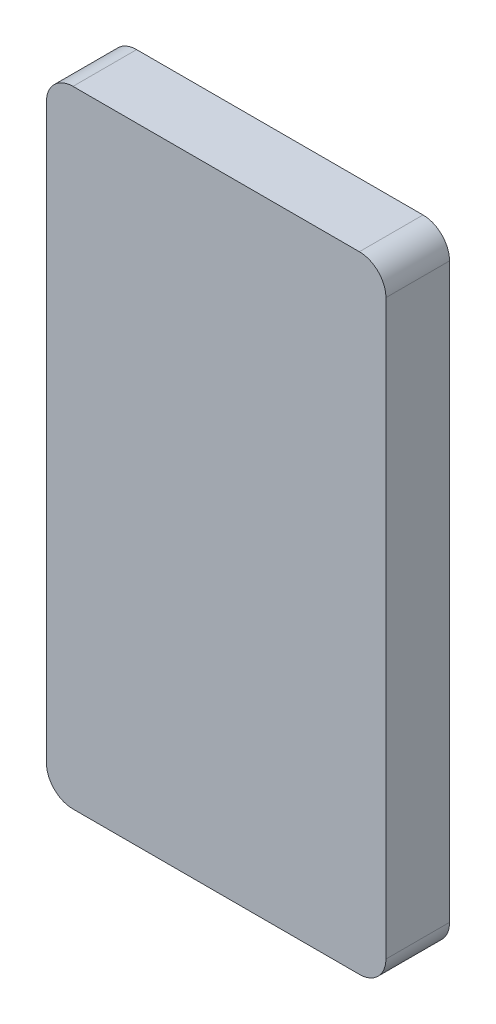
ISO-10303-21;
HEADER;
FILE_DESCRIPTION(('STEP AP214'),'2;1');
FILE_NAME('part.step','',(''),(''),'','','');
FILE_SCHEMA(('AUTOMOTIVE_DESIGN { 1 0 10303 214 1 1 1 1 }'));
ENDSEC;
DATA;
#1=APPLICATION_CONTEXT('core data for automotive mechanical design processes');
#2=APPLICATION_PROTOCOL_DEFINITION('international standard','automotive_design',2000,#1);
#3=PRODUCT_CONTEXT('',#1,'mechanical');
#4=PRODUCT('Part','Part','',(#3));
#5=PRODUCT_RELATED_PRODUCT_CATEGORY('part','',(#4));
#6=PRODUCT_DEFINITION_FORMATION('','',#4);
#7=PRODUCT_DEFINITION_CONTEXT('part definition',#1,'design');
#8=PRODUCT_DEFINITION('design','',#6,#7);
#9=PRODUCT_DEFINITION_SHAPE('','',#8);
#10=(LENGTH_UNIT() NAMED_UNIT(*) SI_UNIT(.MILLI.,.METRE.));
#11=(NAMED_UNIT(*) PLANE_ANGLE_UNIT() SI_UNIT($,.RADIAN.));
#12=(NAMED_UNIT(*) SI_UNIT($,.STERADIAN.) SOLID_ANGLE_UNIT());
#13=UNCERTAINTY_MEASURE_WITH_UNIT(LENGTH_MEASURE(1.E-05),#10,'distance_accuracy_value','');
#14=(GEOMETRIC_REPRESENTATION_CONTEXT(3) GLOBAL_UNCERTAINTY_ASSIGNED_CONTEXT((#13)) GLOBAL_UNIT_ASSIGNED_CONTEXT((#10,
#11,#12)) REPRESENTATION_CONTEXT('',''));
#15=CARTESIAN_POINT('',(0.,0.,0.));
#16=DIRECTION('',(0.,0.,1.));
#17=DIRECTION('',(1.,0.,0.));
#18=AXIS2_PLACEMENT_3D('',#15,#16,#17);
#19=CARTESIAN_POINT('',(5.,5.,-12.));
#20=DIRECTION('',(0.,0.,1.));
#21=DIRECTION('',(1.,0.,0.));
#22=AXIS2_PLACEMENT_3D('',#19,#20,#21);
#23=CYLINDRICAL_SURFACE('',#22,5.);
#24=CARTESIAN_POINT('',(5.,5.,0.));
#25=DIRECTION('',(0.,0.,1.));
#26=DIRECTION('',(-1.,0.,0.));
#27=AXIS2_PLACEMENT_3D('',#24,#25,#26);
#28=CIRCLE('',#27,5.);
#29=CARTESIAN_POINT('',(0.,5.00000000000004,0.));
#30=VERTEX_POINT('',#29);
#31=CARTESIAN_POINT('',(5.00000000000004,0.,0.));
#32=VERTEX_POINT('',#31);
#33=EDGE_CURVE('E141',#30,#32,#28,.T.);
#34=ORIENTED_EDGE('',*,*,#33,.F.);
#35=DIRECTION('',(0.,0.,1.));
#36=VECTOR('',#35,1.);
#37=CARTESIAN_POINT('',(0.,5.00000000000004,-12.));
#38=LINE('',#37,#36);
#39=CARTESIAN_POINT('',(0.,5.00000000000004,-12.));
#40=VERTEX_POINT('',#39);
#41=EDGE_CURVE('E11',#40,#30,#38,.T.);
#42=ORIENTED_EDGE('',*,*,#41,.F.);
#43=CARTESIAN_POINT('',(5.,5.,-12.));
#44=DIRECTION('',(0.,0.,1.));
#45=DIRECTION('',(-1.,0.,0.));
#46=AXIS2_PLACEMENT_3D('',#43,#44,#45);
#47=CIRCLE('',#46,5.);
#48=CARTESIAN_POINT('',(5.00000000000004,0.,-12.));
#49=VERTEX_POINT('',#48);
#50=EDGE_CURVE('E162',#40,#49,#47,.T.);
#51=ORIENTED_EDGE('',*,*,#50,.T.);
#52=DIRECTION('',(0.,0.,1.));
#53=VECTOR('',#52,1.);
#54=CARTESIAN_POINT('',(5.00000000000004,0.,-12.));
#55=LINE('',#54,#53);
#56=EDGE_CURVE('E34',#49,#32,#55,.T.);
#57=ORIENTED_EDGE('',*,*,#56,.T.);
#58=EDGE_LOOP('',(#34,#42,#51,#57));
#59=FACE_BOUND('',#58,.T.);
#60=ADVANCED_FACE('F31',(#59),#23,.T.);
#61=CARTESIAN_POINT('',(0.,5.00000000000004,-12.));
#62=DIRECTION('',(-1.,0.,0.));
#63=DIRECTION('',(0.,0.,1.));
#64=AXIS2_PLACEMENT_3D('',#61,#62,#63);
#65=PLANE('',#64);
#66=DIRECTION('',(0.,0.,1.));
#67=VECTOR('',#66,1.);
#68=CARTESIAN_POINT('',(0.,28.85,-7.4));
#69=LINE('',#68,#67);
#70=CARTESIAN_POINT('',(0.,28.85,-7.4));
#71=VERTEX_POINT('',#70);
#72=CARTESIAN_POINT('',(0.,28.85,-4.6));
#73=VERTEX_POINT('',#72);
#74=EDGE_CURVE('E47',#71,#73,#69,.T.);
#75=ORIENTED_EDGE('',*,*,#74,.F.);
#76=DIRECTION('',(0.,1.,0.));
#77=VECTOR('',#76,1.);
#78=CARTESIAN_POINT('',(0.,28.85,-7.4));
#79=LINE('',#78,#77);
#80=CARTESIAN_POINT('',(0.,36.15,-7.4));
#81=VERTEX_POINT('',#80);
#82=EDGE_CURVE('E240',#71,#81,#79,.T.);
#83=ORIENTED_EDGE('',*,*,#82,.T.);
#84=DIRECTION('',(0.,0.,-1.));
#85=VECTOR('',#84,1.);
#86=CARTESIAN_POINT('',(0.,36.15,-4.6));
#87=LINE('',#86,#85);
#88=CARTESIAN_POINT('',(0.,36.15,-4.6));
#89=VERTEX_POINT('',#88);
#90=EDGE_CURVE('E245',#89,#81,#87,.T.);
#91=ORIENTED_EDGE('',*,*,#90,.F.);
#92=DIRECTION('',(0.,1.,0.));
#93=VECTOR('',#92,1.);
#94=CARTESIAN_POINT('',(0.,28.85,-4.6));
#95=LINE('',#94,#93);
#96=EDGE_CURVE('E252',#73,#89,#95,.T.);
#97=ORIENTED_EDGE('',*,*,#96,.F.);
#98=EDGE_LOOP('',(#75,#83,#91,#97));
#99=FACE_BOUND('',#98,.T.);
#100=DIRECTION('',(0.,-1.,0.));
#101=VECTOR('',#100,1.);
#102=CARTESIAN_POINT('',(0.,5.00000000000004,0.));
#103=LINE('',#102,#101);
#104=CARTESIAN_POINT('',(0.,113.,0.));
#105=VERTEX_POINT('',#104);
#106=EDGE_CURVE('E160',#105,#30,#103,.T.);
#107=ORIENTED_EDGE('',*,*,#106,.F.);
#108=DIRECTION('',(0.,0.,1.));
#109=VECTOR('',#108,1.);
#110=CARTESIAN_POINT('',(0.,113.,-12.));
#111=LINE('',#110,#109);
#112=CARTESIAN_POINT('',(0.,113.,-12.));
#113=VERTEX_POINT('',#112);
#114=EDGE_CURVE('E39',#113,#105,#111,.T.);
#115=ORIENTED_EDGE('',*,*,#114,.F.);
#116=DIRECTION('',(0.,-1.,0.));
#117=VECTOR('',#116,1.);
#118=CARTESIAN_POINT('',(0.,5.00000000000004,-12.));
#119=LINE('',#118,#117);
#120=EDGE_CURVE('E131',#113,#40,#119,.T.);
#121=ORIENTED_EDGE('',*,*,#120,.T.);
#122=ORIENTED_EDGE('',*,*,#41,.T.);
#123=EDGE_LOOP('',(#107,#115,#121,#122));
#124=FACE_BOUND('',#123,.T.);
#125=ADVANCED_FACE('F174',(#99,#124),#65,.T.);
#126=CARTESIAN_POINT('',(5.,113.,-12.));
#127=DIRECTION('',(0.,0.,1.));
#128=DIRECTION('',(1.,0.,0.));
#129=AXIS2_PLACEMENT_3D('',#126,#127,#128);
#130=CYLINDRICAL_SURFACE('',#129,5.);
#131=CARTESIAN_POINT('',(5.,113.,0.));
#132=DIRECTION('',(0.,0.,1.));
#133=DIRECTION('',(-1.,0.,0.));
#134=AXIS2_PLACEMENT_3D('',#131,#132,#133);
#135=CIRCLE('',#134,5.);
#136=CARTESIAN_POINT('',(5.00000000000004,118.,0.));
#137=VERTEX_POINT('',#136);
#138=EDGE_CURVE('E118',#137,#105,#135,.T.);
#139=ORIENTED_EDGE('',*,*,#138,.F.);
#140=DIRECTION('',(0.,0.,1.));
#141=VECTOR('',#140,1.);
#142=CARTESIAN_POINT('',(5.00000000000004,118.,-12.));
#143=LINE('',#142,#141);
#144=CARTESIAN_POINT('',(5.00000000000004,118.,-12.));
#145=VERTEX_POINT('',#144);
#146=EDGE_CURVE('E112',#145,#137,#143,.T.);
#147=ORIENTED_EDGE('',*,*,#146,.F.);
#148=CARTESIAN_POINT('',(5.,113.,-12.));
#149=DIRECTION('',(0.,0.,1.));
#150=DIRECTION('',(-1.,0.,0.));
#151=AXIS2_PLACEMENT_3D('',#148,#149,#150);
#152=CIRCLE('',#151,5.);
#153=EDGE_CURVE('E115',#145,#113,#152,.T.);
#154=ORIENTED_EDGE('',*,*,#153,.T.);
#155=ORIENTED_EDGE('',*,*,#114,.T.);
#156=EDGE_LOOP('',(#139,#147,#154,#155));
#157=FACE_BOUND('',#156,.T.);
#158=ADVANCED_FACE('F114',(#157),#130,.T.);
#159=CARTESIAN_POINT('',(5.00000000000004,118.,-12.));
#160=DIRECTION('',(0.,1.,0.));
#161=DIRECTION('',(0.,0.,1.));
#162=AXIS2_PLACEMENT_3D('',#159,#160,#161);
#163=PLANE('',#162);
#164=DIRECTION('',(-1.,0.,0.));
#165=VECTOR('',#164,1.);
#166=CARTESIAN_POINT('',(5.00000000000004,118.,0.));
#167=LINE('',#166,#165);
#168=CARTESIAN_POINT('',(59.,118.,0.));
#169=VERTEX_POINT('',#168);
#170=EDGE_CURVE('E157',#169,#137,#167,.T.);
#171=ORIENTED_EDGE('',*,*,#170,.F.);
#172=DIRECTION('',(0.,0.,1.));
#173=VECTOR('',#172,1.);
#174=CARTESIAN_POINT('',(59.,118.,-12.));
#175=LINE('',#174,#173);
#176=CARTESIAN_POINT('',(59.,118.,-12.));
#177=VERTEX_POINT('',#176);
#178=EDGE_CURVE('E123',#177,#169,#175,.T.);
#179=ORIENTED_EDGE('',*,*,#178,.F.);
#180=DIRECTION('',(-1.,0.,0.));
#181=VECTOR('',#180,1.);
#182=CARTESIAN_POINT('',(5.00000000000004,118.,-12.));
#183=LINE('',#182,#181);
#184=EDGE_CURVE('E129',#177,#145,#183,.T.);
#185=ORIENTED_EDGE('',*,*,#184,.T.);
#186=ORIENTED_EDGE('',*,*,#146,.T.);
#187=EDGE_LOOP('',(#171,#179,#185,#186));
#188=FACE_BOUND('',#187,.T.);
#189=ADVANCED_FACE('F133',(#188),#163,.T.);
#190=CARTESIAN_POINT('',(59.,113.,-12.));
#191=DIRECTION('',(0.,0.,1.));
#192=DIRECTION('',(1.,0.,0.));
#193=AXIS2_PLACEMENT_3D('',#190,#191,#192);
#194=CYLINDRICAL_SURFACE('',#193,5.);
#195=CARTESIAN_POINT('',(59.,113.,0.));
#196=DIRECTION('',(0.,0.,1.));
#197=DIRECTION('',(-1.,0.,0.));
#198=AXIS2_PLACEMENT_3D('',#195,#196,#197);
#199=CIRCLE('',#198,5.);
#200=CARTESIAN_POINT('',(64.,113.,0.));
#201=VERTEX_POINT('',#200);
#202=EDGE_CURVE('E154',#201,#169,#199,.T.);
#203=ORIENTED_EDGE('',*,*,#202,.F.);
#204=DIRECTION('',(0.,0.,1.));
#205=VECTOR('',#204,1.);
#206=CARTESIAN_POINT('',(64.,113.,-12.));
#207=LINE('',#206,#205);
#208=CARTESIAN_POINT('',(64.,113.,-12.));
#209=VERTEX_POINT('',#208);
#210=EDGE_CURVE('E166',#209,#201,#207,.T.);
#211=ORIENTED_EDGE('',*,*,#210,.F.);
#212=CARTESIAN_POINT('',(59.,113.,-12.));
#213=DIRECTION('',(0.,0.,1.));
#214=DIRECTION('',(-1.,0.,0.));
#215=AXIS2_PLACEMENT_3D('',#212,#213,#214);
#216=CIRCLE('',#215,5.);
#217=EDGE_CURVE('E134',#209,#177,#216,.T.);
#218=ORIENTED_EDGE('',*,*,#217,.T.);
#219=ORIENTED_EDGE('',*,*,#178,.T.);
#220=EDGE_LOOP('',(#203,#211,#218,#219));
#221=FACE_BOUND('',#220,.T.);
#222=ADVANCED_FACE('F188',(#221),#194,.T.);
#223=CARTESIAN_POINT('',(64.,5.00000000000004,-12.));
#224=DIRECTION('',(1.,0.,0.));
#225=DIRECTION('',(0.,0.,-1.));
#226=AXIS2_PLACEMENT_3D('',#223,#224,#225);
#227=PLANE('',#226);
#228=DIRECTION('',(0.,1.,0.));
#229=VECTOR('',#228,1.);
#230=CARTESIAN_POINT('',(64.,5.00000000000004,0.));
#231=LINE('',#230,#229);
#232=CARTESIAN_POINT('',(64.,5.00000000000003,0.));
#233=VERTEX_POINT('',#232);
#234=EDGE_CURVE('E151',#233,#201,#231,.T.);
#235=ORIENTED_EDGE('',*,*,#234,.F.);
#236=DIRECTION('',(0.,0.,1.));
#237=VECTOR('',#236,1.);
#238=CARTESIAN_POINT('',(64.,5.00000000000003,-12.));
#239=LINE('',#238,#237);
#240=CARTESIAN_POINT('',(64.,5.00000000000003,-12.));
#241=VERTEX_POINT('',#240);
#242=EDGE_CURVE('E168',#241,#233,#239,.T.);
#243=ORIENTED_EDGE('',*,*,#242,.F.);
#244=DIRECTION('',(0.,1.,0.));
#245=VECTOR('',#244,1.);
#246=CARTESIAN_POINT('',(64.,5.00000000000004,-12.));
#247=LINE('',#246,#245);
#248=EDGE_CURVE('E136',#241,#209,#247,.T.);
#249=ORIENTED_EDGE('',*,*,#248,.T.);
#250=ORIENTED_EDGE('',*,*,#210,.T.);
#251=EDGE_LOOP('',(#235,#243,#249,#250));
#252=FACE_BOUND('',#251,.T.);
#253=ADVANCED_FACE('F191',(#252),#227,.T.);
#254=CARTESIAN_POINT('',(59.,5.,-12.));
#255=DIRECTION('',(0.,0.,1.));
#256=DIRECTION('',(1.,0.,0.));
#257=AXIS2_PLACEMENT_3D('',#254,#255,#256);
#258=CYLINDRICAL_SURFACE('',#257,5.);
#259=CARTESIAN_POINT('',(59.,5.,0.));
#260=DIRECTION('',(0.,0.,1.));
#261=DIRECTION('',(1.,0.,0.));
#262=AXIS2_PLACEMENT_3D('',#259,#260,#261);
#263=CIRCLE('',#262,5.);
#264=CARTESIAN_POINT('',(59.,0.,0.));
#265=VERTEX_POINT('',#264);
#266=EDGE_CURVE('E148',#265,#233,#263,.T.);
#267=ORIENTED_EDGE('',*,*,#266,.F.);
#268=DIRECTION('',(0.,0.,1.));
#269=VECTOR('',#268,1.);
#270=CARTESIAN_POINT('',(59.,0.,-12.));
#271=LINE('',#270,#269);
#272=CARTESIAN_POINT('',(59.,0.,-12.));
#273=VERTEX_POINT('',#272);
#274=EDGE_CURVE('E169',#273,#265,#271,.T.);
#275=ORIENTED_EDGE('',*,*,#274,.F.);
#276=CARTESIAN_POINT('',(59.,5.,-12.));
#277=DIRECTION('',(0.,0.,1.));
#278=DIRECTION('',(1.,0.,0.));
#279=AXIS2_PLACEMENT_3D('',#276,#277,#278);
#280=CIRCLE('',#279,5.);
#281=EDGE_CURVE('E268',#273,#241,#280,.T.);
#282=ORIENTED_EDGE('',*,*,#281,.T.);
#283=ORIENTED_EDGE('',*,*,#242,.T.);
#284=EDGE_LOOP('',(#267,#275,#282,#283));
#285=FACE_BOUND('',#284,.T.);
#286=ADVANCED_FACE('F195',(#285),#258,.T.);
#287=CARTESIAN_POINT('',(5.00000000000004,0.,-12.));
#288=DIRECTION('',(0.,-1.,0.));
#289=DIRECTION('',(0.,0.,-1.));
#290=AXIS2_PLACEMENT_3D('',#287,#288,#289);
#291=PLANE('',#290);
#292=DIRECTION('',(1.,0.,0.));
#293=VECTOR('',#292,1.);
#294=CARTESIAN_POINT('',(5.00000000000004,0.,0.));
#295=LINE('',#294,#293);
#296=EDGE_CURVE('E144',#32,#265,#295,.T.);
#297=ORIENTED_EDGE('',*,*,#296,.F.);
#298=ORIENTED_EDGE('',*,*,#56,.F.);
#299=DIRECTION('',(1.,0.,0.));
#300=VECTOR('',#299,1.);
#301=CARTESIAN_POINT('',(5.00000000000004,0.,-12.));
#302=LINE('',#301,#300);
#303=EDGE_CURVE('E266',#49,#273,#302,.T.);
#304=ORIENTED_EDGE('',*,*,#303,.T.);
#305=ORIENTED_EDGE('',*,*,#274,.T.);
#306=EDGE_LOOP('',(#297,#298,#304,#305));
#307=FACE_BOUND('',#306,.T.);
#308=ADVANCED_FACE('F171',(#307),#291,.T.);
#309=CARTESIAN_POINT('',(5.,5.,-12.));
#310=DIRECTION('',(0.,0.,-1.));
#311=DIRECTION('',(-1.,0.,0.));
#312=AXIS2_PLACEMENT_3D('',#309,#310,#311);
#313=PLANE('',#312);
#314=ORIENTED_EDGE('',*,*,#50,.F.);
#315=ORIENTED_EDGE('',*,*,#120,.F.);
#316=ORIENTED_EDGE('',*,*,#153,.F.);
#317=ORIENTED_EDGE('',*,*,#184,.F.);
#318=ORIENTED_EDGE('',*,*,#217,.F.);
#319=ORIENTED_EDGE('',*,*,#248,.F.);
#320=ORIENTED_EDGE('',*,*,#281,.F.);
#321=ORIENTED_EDGE('',*,*,#303,.F.);
#322=EDGE_LOOP('',(#314,#315,#316,#317,#318,#319,#320,#321));
#323=FACE_BOUND('',#322,.T.);
#324=ADVANCED_FACE('F127',(#323),#313,.T.);
#325=CARTESIAN_POINT('',(5.,5.,0.));
#326=DIRECTION('',(0.,0.,-1.));
#327=DIRECTION('',(-1.,0.,0.));
#328=AXIS2_PLACEMENT_3D('',#325,#326,#327);
#329=PLANE('',#328);
#330=ORIENTED_EDGE('',*,*,#33,.T.);
#331=ORIENTED_EDGE('',*,*,#296,.T.);
#332=ORIENTED_EDGE('',*,*,#266,.T.);
#333=ORIENTED_EDGE('',*,*,#234,.T.);
#334=ORIENTED_EDGE('',*,*,#202,.T.);
#335=ORIENTED_EDGE('',*,*,#170,.T.);
#336=ORIENTED_EDGE('',*,*,#138,.T.);
#337=ORIENTED_EDGE('',*,*,#106,.T.);
#338=EDGE_LOOP('',(#330,#331,#332,#333,#334,#335,#336,#337));
#339=FACE_BOUND('',#338,.T.);
#340=ADVANCED_FACE('F173',(#339),#329,.F.);
#341=CARTESIAN_POINT('',(10.,28.85,-7.4));
#342=DIRECTION('',(0.,-1.,0.));
#343=DIRECTION('',(0.,0.,-1.));
#344=AXIS2_PLACEMENT_3D('',#341,#342,#343);
#345=PLANE('',#344);
#346=ORIENTED_EDGE('',*,*,#74,.T.);
#347=DIRECTION('',(-1.,0.,0.));
#348=VECTOR('',#347,1.);
#349=CARTESIAN_POINT('',(10.,28.85,-4.6));
#350=LINE('',#349,#348);
#351=CARTESIAN_POINT('',(10.,28.85,-4.6));
#352=VERTEX_POINT('',#351);
#353=EDGE_CURVE('E250',#352,#73,#350,.T.);
#354=ORIENTED_EDGE('',*,*,#353,.F.);
#355=DIRECTION('',(0.,0.,1.));
#356=VECTOR('',#355,1.);
#357=CARTESIAN_POINT('',(10.,28.85,-7.4));
#358=LINE('',#357,#356);
#359=CARTESIAN_POINT('',(10.,28.85,-7.4));
#360=VERTEX_POINT('',#359);
#361=EDGE_CURVE('E232',#360,#352,#358,.T.);
#362=ORIENTED_EDGE('',*,*,#361,.F.);
#363=DIRECTION('',(-1.,0.,0.));
#364=VECTOR('',#363,1.);
#365=CARTESIAN_POINT('',(10.,28.85,-7.4));
#366=LINE('',#365,#364);
#367=EDGE_CURVE('E145',#360,#71,#366,.T.);
#368=ORIENTED_EDGE('',*,*,#367,.T.);
#369=EDGE_LOOP('',(#346,#354,#362,#368));
#370=FACE_BOUND('',#369,.T.);
#371=ADVANCED_FACE('F206',(#370),#345,.F.);
#372=CARTESIAN_POINT('',(10.,28.85,-7.4));
#373=DIRECTION('',(0.,0.,1.));
#374=DIRECTION('',(1.,0.,0.));
#375=AXIS2_PLACEMENT_3D('',#372,#373,#374);
#376=PLANE('',#375);
#377=ORIENTED_EDGE('',*,*,#82,.F.);
#378=ORIENTED_EDGE('',*,*,#367,.F.);
#379=DIRECTION('',(0.,1.,0.));
#380=VECTOR('',#379,1.);
#381=CARTESIAN_POINT('',(10.,28.85,-7.4));
#382=LINE('',#381,#380);
#383=CARTESIAN_POINT('',(10.,36.15,-7.4));
#384=VERTEX_POINT('',#383);
#385=EDGE_CURVE('E238',#360,#384,#382,.T.);
#386=ORIENTED_EDGE('',*,*,#385,.T.);
#387=DIRECTION('',(-1.,0.,0.));
#388=VECTOR('',#387,1.);
#389=CARTESIAN_POINT('',(10.,36.15,-7.4));
#390=LINE('',#389,#388);
#391=EDGE_CURVE('E258',#384,#81,#390,.T.);
#392=ORIENTED_EDGE('',*,*,#391,.T.);
#393=EDGE_LOOP('',(#377,#378,#386,#392));
#394=FACE_BOUND('',#393,.T.);
#395=ADVANCED_FACE('F210',(#394),#376,.T.);
#396=CARTESIAN_POINT('',(10.,36.15,-4.6));
#397=DIRECTION('',(0.,1.,0.));
#398=DIRECTION('',(0.,0.,1.));
#399=AXIS2_PLACEMENT_3D('',#396,#397,#398);
#400=PLANE('',#399);
#401=ORIENTED_EDGE('',*,*,#90,.T.);
#402=ORIENTED_EDGE('',*,*,#391,.F.);
#403=DIRECTION('',(0.,0.,-1.));
#404=VECTOR('',#403,1.);
#405=CARTESIAN_POINT('',(10.,36.15,-4.6));
#406=LINE('',#405,#404);
#407=CARTESIAN_POINT('',(10.,36.15,-4.6));
#408=VERTEX_POINT('',#407);
#409=EDGE_CURVE('E242',#408,#384,#406,.T.);
#410=ORIENTED_EDGE('',*,*,#409,.F.);
#411=DIRECTION('',(-1.,0.,0.));
#412=VECTOR('',#411,1.);
#413=CARTESIAN_POINT('',(10.,36.15,-4.6));
#414=LINE('',#413,#412);
#415=EDGE_CURVE('E261',#408,#89,#414,.T.);
#416=ORIENTED_EDGE('',*,*,#415,.T.);
#417=EDGE_LOOP('',(#401,#402,#410,#416));
#418=FACE_BOUND('',#417,.T.);
#419=ADVANCED_FACE('F215',(#418),#400,.F.);
#420=CARTESIAN_POINT('',(10.,28.85,-4.6));
#421=DIRECTION('',(0.,0.,1.));
#422=DIRECTION('',(1.,0.,0.));
#423=AXIS2_PLACEMENT_3D('',#420,#421,#422);
#424=PLANE('',#423);
#425=ORIENTED_EDGE('',*,*,#96,.T.);
#426=ORIENTED_EDGE('',*,*,#415,.F.);
#427=DIRECTION('',(0.,1.,0.));
#428=VECTOR('',#427,1.);
#429=CARTESIAN_POINT('',(10.,28.85,-4.6));
#430=LINE('',#429,#428);
#431=EDGE_CURVE('E236',#352,#408,#430,.T.);
#432=ORIENTED_EDGE('',*,*,#431,.F.);
#433=ORIENTED_EDGE('',*,*,#353,.T.);
#434=EDGE_LOOP('',(#425,#426,#432,#433));
#435=FACE_BOUND('',#434,.T.);
#436=ADVANCED_FACE('F211',(#435),#424,.F.);
#437=CARTESIAN_POINT('',(10.,28.85,-4.6));
#438=DIRECTION('',(-1.,0.,0.));
#439=DIRECTION('',(0.,0.,1.));
#440=AXIS2_PLACEMENT_3D('',#437,#438,#439);
#441=PLANE('',#440);
#442=ORIENTED_EDGE('',*,*,#361,.T.);
#443=ORIENTED_EDGE('',*,*,#431,.T.);
#444=ORIENTED_EDGE('',*,*,#409,.T.);
#445=ORIENTED_EDGE('',*,*,#385,.F.);
#446=EDGE_LOOP('',(#442,#443,#444,#445));
#447=FACE_BOUND('',#446,.T.);
#448=ADVANCED_FACE('F214',(#447),#441,.T.);
#449=CLOSED_SHELL('',(#60,#125,#158,#189,#222,#253,#286,#308,#324,#340,#371,#395,#419,#436,#448));
#450=MANIFOLD_SOLID_BREP('B2',#449);
#451=ADVANCED_BREP_SHAPE_REPRESENTATION('',(#18,#450),#14);
#452=SHAPE_DEFINITION_REPRESENTATION(#9,#451);
ENDSEC;
END-ISO-10303-21;
